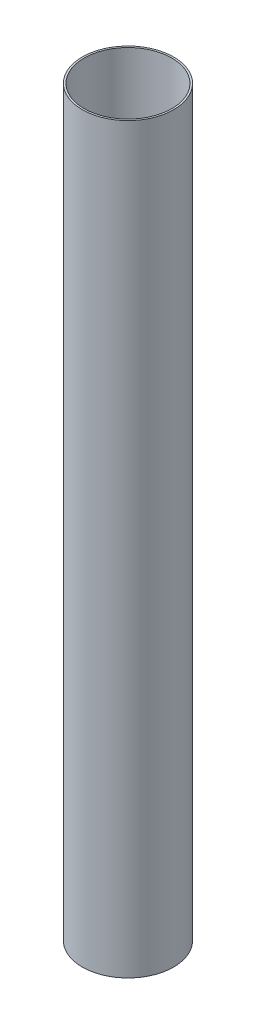
ISO-10303-21;
HEADER;
FILE_DESCRIPTION(('STEP AP214'),'2;1');
FILE_NAME('part.step','',(''),(''),'','','');
FILE_SCHEMA(('AUTOMOTIVE_DESIGN { 1 0 10303 214 1 1 1 1 }'));
ENDSEC;
DATA;
#1=APPLICATION_CONTEXT('core data for automotive mechanical design processes');
#2=APPLICATION_PROTOCOL_DEFINITION('international standard','automotive_design',2000,#1);
#3=PRODUCT_CONTEXT('',#1,'mechanical');
#4=PRODUCT('Part','Part','',(#3));
#5=PRODUCT_RELATED_PRODUCT_CATEGORY('part','',(#4));
#6=PRODUCT_DEFINITION_FORMATION('','',#4);
#7=PRODUCT_DEFINITION_CONTEXT('part definition',#1,'design');
#8=PRODUCT_DEFINITION('design','',#6,#7);
#9=PRODUCT_DEFINITION_SHAPE('','',#8);
#10=(LENGTH_UNIT() NAMED_UNIT(*) SI_UNIT(.MILLI.,.METRE.));
#11=(NAMED_UNIT(*) PLANE_ANGLE_UNIT() SI_UNIT($,.RADIAN.));
#12=(NAMED_UNIT(*) SI_UNIT($,.STERADIAN.) SOLID_ANGLE_UNIT());
#13=UNCERTAINTY_MEASURE_WITH_UNIT(LENGTH_MEASURE(1.E-05),#10,'distance_accuracy_value','');
#14=(GEOMETRIC_REPRESENTATION_CONTEXT(3) GLOBAL_UNCERTAINTY_ASSIGNED_CONTEXT((#13)) GLOBAL_UNIT_ASSIGNED_CONTEXT((#10,
#11,#12)) REPRESENTATION_CONTEXT('',''));
#15=CARTESIAN_POINT('',(0.,0.,0.));
#16=DIRECTION('',(0.,0.,1.));
#17=DIRECTION('',(1.,0.,0.));
#18=AXIS2_PLACEMENT_3D('',#15,#16,#17);
#19=CARTESIAN_POINT('',(0.,123.620053705202,0.));
#20=DIRECTION('',(0.,1.,0.));
#21=DIRECTION('',(0.,0.,1.));
#22=AXIS2_PLACEMENT_3D('',#19,#20,#21);
#23=CYLINDRICAL_SURFACE('',#22,51.5874);
#24=CARTESIAN_POINT('',(0.,838.2,0.));
#25=DIRECTION('',(0.,1.,0.));
#26=DIRECTION('',(0.,0.,1.));
#27=AXIS2_PLACEMENT_3D('',#24,#25,#26);
#28=CIRCLE('',#27,51.5874);
#29=CARTESIAN_POINT('',(0.,838.2,51.5874));
#30=VERTEX_POINT('',#29);
#31=EDGE_CURVE('E10',#30,#30,#28,.T.);
#32=ORIENTED_EDGE('',*,*,#31,.F.);
#33=EDGE_LOOP('',(#32));
#34=FACE_BOUND('',#33,.T.);
#35=CARTESIAN_POINT('',(0.,0.,0.));
#36=DIRECTION('',(0.,1.,0.));
#37=DIRECTION('',(0.,0.,1.));
#38=AXIS2_PLACEMENT_3D('',#35,#36,#37);
#39=CIRCLE('',#38,51.5874);
#40=CARTESIAN_POINT('',(0.,0.,51.5874));
#41=VERTEX_POINT('',#40);
#42=EDGE_CURVE('E50',#41,#41,#39,.T.);
#43=ORIENTED_EDGE('',*,*,#42,.T.);
#44=EDGE_LOOP('',(#43));
#45=FACE_BOUND('',#44,.T.);
#46=ADVANCED_FACE('F36',(#34,#45),#23,.T.);
#47=CARTESIAN_POINT('',(51.5874,838.2,0.));
#48=DIRECTION('',(0.,-1.,0.));
#49=DIRECTION('',(0.,0.,-1.));
#50=AXIS2_PLACEMENT_3D('',#47,#48,#49);
#51=PLANE('',#50);
#52=CARTESIAN_POINT('',(0.,838.2,0.));
#53=DIRECTION('',(0.,1.,0.));
#54=DIRECTION('',(0.,0.,1.));
#55=AXIS2_PLACEMENT_3D('',#52,#53,#54);
#56=CIRCLE('',#55,49.53);
#57=CARTESIAN_POINT('',(0.,838.2,49.53));
#58=VERTEX_POINT('',#57);
#59=EDGE_CURVE('E42',#58,#58,#56,.T.);
#60=ORIENTED_EDGE('',*,*,#59,.F.);
#61=EDGE_LOOP('',(#60));
#62=FACE_BOUND('',#61,.T.);
#63=ORIENTED_EDGE('',*,*,#31,.T.);
#64=EDGE_LOOP('',(#63));
#65=FACE_BOUND('',#64,.T.);
#66=ADVANCED_FACE('F65',(#62,#65),#51,.F.);
#67=CARTESIAN_POINT('',(0.,123.620053705202,0.));
#68=DIRECTION('',(0.,1.,0.));
#69=DIRECTION('',(0.,0.,1.));
#70=AXIS2_PLACEMENT_3D('',#67,#68,#69);
#71=CYLINDRICAL_SURFACE('',#70,49.53);
#72=CARTESIAN_POINT('',(0.,0.,0.));
#73=DIRECTION('',(0.,1.,0.));
#74=DIRECTION('',(0.,0.,1.));
#75=AXIS2_PLACEMENT_3D('',#72,#73,#74);
#76=CIRCLE('',#75,49.53);
#77=CARTESIAN_POINT('',(0.,0.,49.53));
#78=VERTEX_POINT('',#77);
#79=EDGE_CURVE('E46',#78,#78,#76,.T.);
#80=ORIENTED_EDGE('',*,*,#79,.F.);
#81=EDGE_LOOP('',(#80));
#82=FACE_BOUND('',#81,.T.);
#83=ORIENTED_EDGE('',*,*,#59,.T.);
#84=EDGE_LOOP('',(#83));
#85=FACE_BOUND('',#84,.T.);
#86=ADVANCED_FACE('F60',(#82,#85),#71,.F.);
#87=CARTESIAN_POINT('',(49.53,0.,0.));
#88=DIRECTION('',(0.,1.,0.));
#89=DIRECTION('',(0.,0.,1.));
#90=AXIS2_PLACEMENT_3D('',#87,#88,#89);
#91=PLANE('',#90);
#92=ORIENTED_EDGE('',*,*,#42,.F.);
#93=EDGE_LOOP('',(#92));
#94=FACE_BOUND('',#93,.T.);
#95=ORIENTED_EDGE('',*,*,#79,.T.);
#96=EDGE_LOOP('',(#95));
#97=FACE_BOUND('',#96,.T.);
#98=ADVANCED_FACE('F57',(#94,#97),#91,.F.);
#99=CLOSED_SHELL('',(#46,#66,#86,#98));
#100=MANIFOLD_SOLID_BREP('B2',#99);
#101=ADVANCED_BREP_SHAPE_REPRESENTATION('',(#18,#100),#14);
#102=SHAPE_DEFINITION_REPRESENTATION(#9,#101);
ENDSEC;
END-ISO-10303-21;
